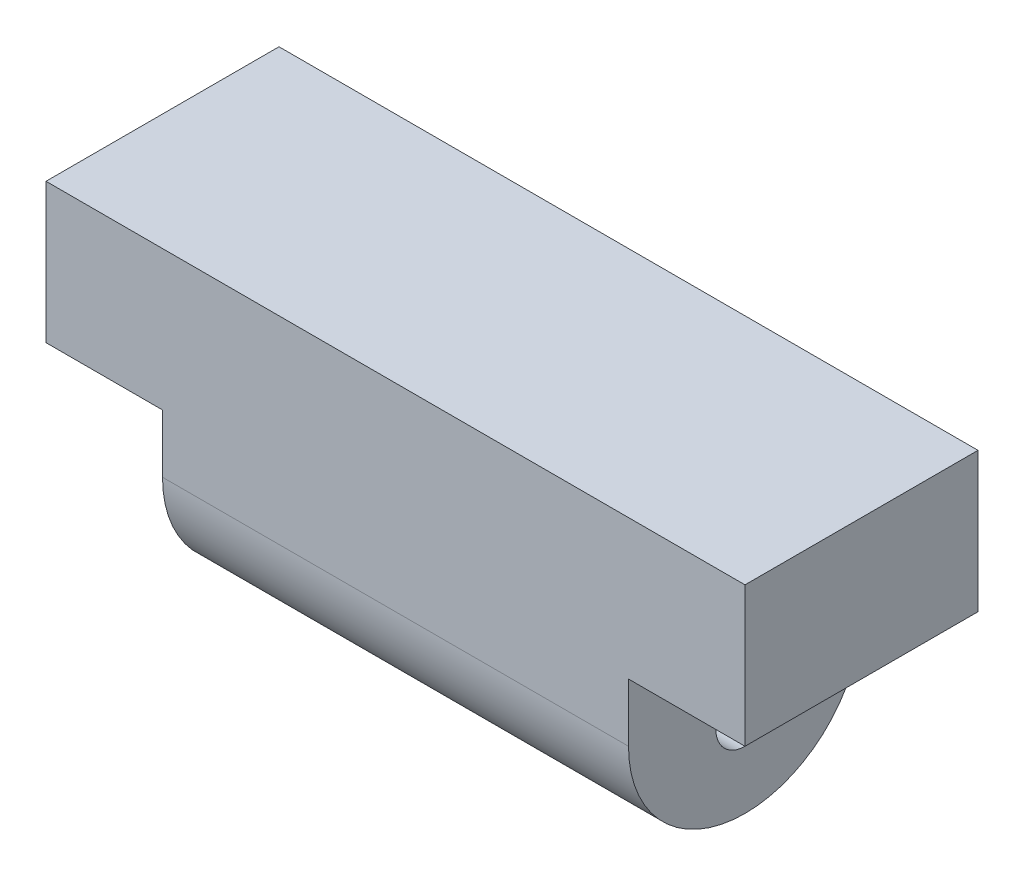
ISO-10303-21;
HEADER;
FILE_DESCRIPTION(('STEP AP214'),'2;1');
FILE_NAME('part.step','',(''),(''),'','','');
FILE_SCHEMA(('AUTOMOTIVE_DESIGN { 1 0 10303 214 1 1 1 1 }'));
ENDSEC;
DATA;
#1=APPLICATION_CONTEXT('core data for automotive mechanical design processes');
#2=APPLICATION_PROTOCOL_DEFINITION('international standard','automotive_design',2000,#1);
#3=PRODUCT_CONTEXT('',#1,'mechanical');
#4=PRODUCT('Part','Part','',(#3));
#5=PRODUCT_RELATED_PRODUCT_CATEGORY('part','',(#4));
#6=PRODUCT_DEFINITION_FORMATION('','',#4);
#7=PRODUCT_DEFINITION_CONTEXT('part definition',#1,'design');
#8=PRODUCT_DEFINITION('design','',#6,#7);
#9=PRODUCT_DEFINITION_SHAPE('','',#8);
#10=(LENGTH_UNIT() NAMED_UNIT(*) SI_UNIT(.MILLI.,.METRE.));
#11=(NAMED_UNIT(*) PLANE_ANGLE_UNIT() SI_UNIT($,.RADIAN.));
#12=(NAMED_UNIT(*) SI_UNIT($,.STERADIAN.) SOLID_ANGLE_UNIT());
#13=UNCERTAINTY_MEASURE_WITH_UNIT(LENGTH_MEASURE(1.E-05),#10,'distance_accuracy_value','');
#14=(GEOMETRIC_REPRESENTATION_CONTEXT(3) GLOBAL_UNCERTAINTY_ASSIGNED_CONTEXT((#13)) GLOBAL_UNIT_ASSIGNED_CONTEXT((#10,
#11,#12)) REPRESENTATION_CONTEXT('',''));
#15=CARTESIAN_POINT('',(0.,0.,0.));
#16=DIRECTION('',(0.,0.,1.));
#17=DIRECTION('',(1.,0.,0.));
#18=AXIS2_PLACEMENT_3D('',#15,#16,#17);
#19=CARTESIAN_POINT('',(-30.,1.49999999999999,20.));
#20=DIRECTION('',(1.,0.,0.));
#21=DIRECTION('',(0.,0.,-1.));
#22=AXIS2_PLACEMENT_3D('',#19,#20,#21);
#23=PLANE('',#22);
#24=DIRECTION('',(0.,-1.,0.));
#25=VECTOR('',#24,1.);
#26=CARTESIAN_POINT('',(-30.,1.49999999999999,0.));
#27=LINE('',#26,#25);
#28=CARTESIAN_POINT('',(-30.,13.5,0.));
#29=VERTEX_POINT('',#28);
#30=CARTESIAN_POINT('',(-30.,1.49999999999999,0.));
#31=VERTEX_POINT('',#30);
#32=EDGE_CURVE('E124',#29,#31,#27,.T.);
#33=ORIENTED_EDGE('',*,*,#32,.T.);
#34=DIRECTION('',(0.,0.,-1.));
#35=VECTOR('',#34,1.);
#36=CARTESIAN_POINT('',(-30.,1.49999999999999,20.));
#37=LINE('',#36,#35);
#38=CARTESIAN_POINT('',(-30.,1.49999999999999,20.));
#39=VERTEX_POINT('',#38);
#40=EDGE_CURVE('E106',#39,#31,#37,.T.);
#41=ORIENTED_EDGE('',*,*,#40,.F.);
#42=DIRECTION('',(0.,-1.,0.));
#43=VECTOR('',#42,1.);
#44=CARTESIAN_POINT('',(-30.,1.49999999999999,20.));
#45=LINE('',#44,#43);
#46=CARTESIAN_POINT('',(-30.,13.5,20.));
#47=VERTEX_POINT('',#46);
#48=EDGE_CURVE('E112',#47,#39,#45,.T.);
#49=ORIENTED_EDGE('',*,*,#48,.F.);
#50=DIRECTION('',(0.,0.,-1.));
#51=VECTOR('',#50,1.);
#52=CARTESIAN_POINT('',(-30.,13.5,20.));
#53=LINE('',#52,#51);
#54=EDGE_CURVE('E160',#47,#29,#53,.T.);
#55=ORIENTED_EDGE('',*,*,#54,.T.);
#56=EDGE_LOOP('',(#33,#41,#49,#55));
#57=FACE_BOUND('',#56,.T.);
#58=ADVANCED_FACE('F33',(#57),#23,.F.);
#59=CARTESIAN_POINT('',(-20.,1.49999999999999,20.));
#60=DIRECTION('',(0.,1.,0.));
#61=DIRECTION('',(-1.,0.,0.));
#62=AXIS2_PLACEMENT_3D('',#59,#60,#61);
#63=PLANE('',#62);
#64=DIRECTION('',(1.,0.,0.));
#65=VECTOR('',#64,1.);
#66=CARTESIAN_POINT('',(-20.,1.49999999999999,0.));
#67=LINE('',#66,#65);
#68=CARTESIAN_POINT('',(-20.,1.49999999999999,0.));
#69=VERTEX_POINT('',#68);
#70=EDGE_CURVE('E149',#31,#69,#67,.T.);
#71=ORIENTED_EDGE('',*,*,#70,.T.);
#72=DIRECTION('',(0.,0.,-1.));
#73=VECTOR('',#72,1.);
#74=CARTESIAN_POINT('',(-20.,1.49999999999999,20.));
#75=LINE('',#74,#73);
#76=CARTESIAN_POINT('',(-20.,1.49999999999999,20.));
#77=VERTEX_POINT('',#76);
#78=EDGE_CURVE('E109',#77,#69,#75,.T.);
#79=ORIENTED_EDGE('',*,*,#78,.F.);
#80=DIRECTION('',(1.,0.,0.));
#81=VECTOR('',#80,1.);
#82=CARTESIAN_POINT('',(-20.,1.49999999999999,20.));
#83=LINE('',#82,#81);
#84=EDGE_CURVE('E102',#39,#77,#83,.T.);
#85=ORIENTED_EDGE('',*,*,#84,.F.);
#86=ORIENTED_EDGE('',*,*,#40,.T.);
#87=EDGE_LOOP('',(#71,#79,#85,#86));
#88=FACE_BOUND('',#87,.T.);
#89=ADVANCED_FACE('F104',(#88),#63,.F.);
#90=CARTESIAN_POINT('',(-20.,-13.5,20.));
#91=DIRECTION('',(1.,0.,0.));
#92=DIRECTION('',(0.,1.,0.));
#93=AXIS2_PLACEMENT_3D('',#90,#91,#92);
#94=PLANE('',#93);
#95=CARTESIAN_POINT('',(-20.,-6.00000000000001,10.));
#96=DIRECTION('',(1.,0.,0.));
#97=DIRECTION('',(0.,1.,0.));
#98=AXIS2_PLACEMENT_3D('',#95,#96,#97);
#99=CIRCLE('',#98,2.5);
#100=CARTESIAN_POINT('',(-20.,-3.50000000000001,10.));
#101=VERTEX_POINT('',#100);
#102=EDGE_CURVE('E188',#101,#101,#99,.T.);
#103=ORIENTED_EDGE('',*,*,#102,.T.);
#104=EDGE_LOOP('',(#103));
#105=FACE_BOUND('',#104,.T.);
#106=DIRECTION('',(0.,-1.,0.));
#107=VECTOR('',#106,1.);
#108=CARTESIAN_POINT('',(-20.,-13.5,0.));
#109=LINE('',#108,#107);
#110=CARTESIAN_POINT('',(-20.,-3.50000000000001,0.));
#111=VERTEX_POINT('',#110);
#112=EDGE_CURVE('E143',#69,#111,#109,.T.);
#113=ORIENTED_EDGE('',*,*,#112,.T.);
#114=CARTESIAN_POINT('',(-20.,-3.50000000000001,10.));
#115=DIRECTION('',(1.,0.,0.));
#116=DIRECTION('',(0.,1.,0.));
#117=AXIS2_PLACEMENT_3D('',#114,#115,#116);
#118=CIRCLE('',#117,10.);
#119=CARTESIAN_POINT('',(-20.,-13.5,10.));
#120=VERTEX_POINT('',#119);
#121=EDGE_CURVE('E42',#111,#120,#118,.F.);
#122=ORIENTED_EDGE('',*,*,#121,.T.);
#123=CARTESIAN_POINT('',(-20.,-3.50000000000001,10.));
#124=DIRECTION('',(1.,0.,0.));
#125=DIRECTION('',(0.,1.,0.));
#126=AXIS2_PLACEMENT_3D('',#123,#124,#125);
#127=CIRCLE('',#126,10.);
#128=CARTESIAN_POINT('',(-20.,-3.50000000000001,20.));
#129=VERTEX_POINT('',#128);
#130=EDGE_CURVE('E49',#120,#129,#127,.F.);
#131=ORIENTED_EDGE('',*,*,#130,.T.);
#132=DIRECTION('',(0.,-1.,0.));
#133=VECTOR('',#132,1.);
#134=CARTESIAN_POINT('',(-20.,-13.5,20.));
#135=LINE('',#134,#133);
#136=EDGE_CURVE('E111',#77,#129,#135,.T.);
#137=ORIENTED_EDGE('',*,*,#136,.F.);
#138=ORIENTED_EDGE('',*,*,#78,.T.);
#139=EDGE_LOOP('',(#113,#122,#131,#137,#138));
#140=FACE_BOUND('',#139,.T.);
#141=ADVANCED_FACE('F148',(#105,#140),#94,.F.);
#142=CARTESIAN_POINT('',(20.,1.5,20.));
#143=DIRECTION('',(-1.,0.,0.));
#144=DIRECTION('',(0.,-1.,0.));
#145=AXIS2_PLACEMENT_3D('',#142,#143,#144);
#146=PLANE('',#145);
#147=CARTESIAN_POINT('',(20.,-6.,10.));
#148=DIRECTION('',(1.,0.,0.));
#149=DIRECTION('',(0.,1.,0.));
#150=AXIS2_PLACEMENT_3D('',#147,#148,#149);
#151=CIRCLE('',#150,2.5);
#152=CARTESIAN_POINT('',(20.,-3.5,10.));
#153=VERTEX_POINT('',#152);
#154=EDGE_CURVE('E190',#153,#153,#151,.T.);
#155=ORIENTED_EDGE('',*,*,#154,.F.);
#156=EDGE_LOOP('',(#155));
#157=FACE_BOUND('',#156,.T.);
#158=CARTESIAN_POINT('',(20.,-3.5,10.));
#159=DIRECTION('',(-1.,0.,0.));
#160=DIRECTION('',(0.,-1.,0.));
#161=AXIS2_PLACEMENT_3D('',#158,#159,#160);
#162=CIRCLE('',#161,10.);
#163=CARTESIAN_POINT('',(20.,-3.5,20.));
#164=VERTEX_POINT('',#163);
#165=CARTESIAN_POINT('',(20.,-13.5,10.));
#166=VERTEX_POINT('',#165);
#167=EDGE_CURVE('E125',#164,#166,#162,.F.);
#168=ORIENTED_EDGE('',*,*,#167,.T.);
#169=CARTESIAN_POINT('',(20.,-3.5,10.));
#170=DIRECTION('',(-1.,0.,0.));
#171=DIRECTION('',(0.,-1.,0.));
#172=AXIS2_PLACEMENT_3D('',#169,#170,#171);
#173=CIRCLE('',#172,10.);
#174=CARTESIAN_POINT('',(20.,-3.5,0.));
#175=VERTEX_POINT('',#174);
#176=EDGE_CURVE('E127',#166,#175,#173,.F.);
#177=ORIENTED_EDGE('',*,*,#176,.T.);
#178=DIRECTION('',(0.,1.,0.));
#179=VECTOR('',#178,1.);
#180=CARTESIAN_POINT('',(20.,1.5,0.));
#181=LINE('',#180,#179);
#182=CARTESIAN_POINT('',(20.,1.5,0.));
#183=VERTEX_POINT('',#182);
#184=EDGE_CURVE('E145',#175,#183,#181,.T.);
#185=ORIENTED_EDGE('',*,*,#184,.T.);
#186=DIRECTION('',(0.,0.,-1.));
#187=VECTOR('',#186,1.);
#188=CARTESIAN_POINT('',(20.,1.5,20.));
#189=LINE('',#188,#187);
#190=CARTESIAN_POINT('',(20.,1.5,20.));
#191=VERTEX_POINT('',#190);
#192=EDGE_CURVE('E129',#191,#183,#189,.T.);
#193=ORIENTED_EDGE('',*,*,#192,.F.);
#194=DIRECTION('',(0.,1.,0.));
#195=VECTOR('',#194,1.);
#196=CARTESIAN_POINT('',(20.,1.5,20.));
#197=LINE('',#196,#195);
#198=EDGE_CURVE('E198',#164,#191,#197,.T.);
#199=ORIENTED_EDGE('',*,*,#198,.F.);
#200=EDGE_LOOP('',(#168,#177,#185,#193,#199));
#201=FACE_BOUND('',#200,.T.);
#202=ADVANCED_FACE('F201',(#157,#201),#146,.F.);
#203=CARTESIAN_POINT('',(30.,1.5,20.));
#204=DIRECTION('',(0.,1.,0.));
#205=DIRECTION('',(-1.,0.,0.));
#206=AXIS2_PLACEMENT_3D('',#203,#204,#205);
#207=PLANE('',#206);
#208=DIRECTION('',(1.,0.,0.));
#209=VECTOR('',#208,1.);
#210=CARTESIAN_POINT('',(30.,1.5,0.));
#211=LINE('',#210,#209);
#212=CARTESIAN_POINT('',(30.,1.5,0.));
#213=VERTEX_POINT('',#212);
#214=EDGE_CURVE('E151',#183,#213,#211,.T.);
#215=ORIENTED_EDGE('',*,*,#214,.T.);
#216=DIRECTION('',(0.,0.,-1.));
#217=VECTOR('',#216,1.);
#218=CARTESIAN_POINT('',(30.,1.5,20.));
#219=LINE('',#218,#217);
#220=CARTESIAN_POINT('',(30.,1.5,20.));
#221=VERTEX_POINT('',#220);
#222=EDGE_CURVE('E165',#221,#213,#219,.T.);
#223=ORIENTED_EDGE('',*,*,#222,.F.);
#224=DIRECTION('',(1.,0.,0.));
#225=VECTOR('',#224,1.);
#226=CARTESIAN_POINT('',(30.,1.5,20.));
#227=LINE('',#226,#225);
#228=EDGE_CURVE('E173',#191,#221,#227,.T.);
#229=ORIENTED_EDGE('',*,*,#228,.F.);
#230=ORIENTED_EDGE('',*,*,#192,.T.);
#231=EDGE_LOOP('',(#215,#223,#229,#230));
#232=FACE_BOUND('',#231,.T.);
#233=ADVANCED_FACE('F171',(#232),#207,.F.);
#234=CARTESIAN_POINT('',(30.,13.5,20.));
#235=DIRECTION('',(-1.,0.,0.));
#236=DIRECTION('',(0.,0.,1.));
#237=AXIS2_PLACEMENT_3D('',#234,#235,#236);
#238=PLANE('',#237);
#239=DIRECTION('',(0.,1.,0.));
#240=VECTOR('',#239,1.);
#241=CARTESIAN_POINT('',(30.,13.5,0.));
#242=LINE('',#241,#240);
#243=CARTESIAN_POINT('',(30.,13.5,0.));
#244=VERTEX_POINT('',#243);
#245=EDGE_CURVE('E157',#213,#244,#242,.T.);
#246=ORIENTED_EDGE('',*,*,#245,.T.);
#247=DIRECTION('',(0.,0.,-1.));
#248=VECTOR('',#247,1.);
#249=CARTESIAN_POINT('',(30.,13.5,20.));
#250=LINE('',#249,#248);
#251=CARTESIAN_POINT('',(30.,13.5,20.));
#252=VERTEX_POINT('',#251);
#253=EDGE_CURVE('E162',#252,#244,#250,.T.);
#254=ORIENTED_EDGE('',*,*,#253,.F.);
#255=DIRECTION('',(0.,1.,0.));
#256=VECTOR('',#255,1.);
#257=CARTESIAN_POINT('',(30.,13.5,20.));
#258=LINE('',#257,#256);
#259=EDGE_CURVE('E184',#221,#252,#258,.T.);
#260=ORIENTED_EDGE('',*,*,#259,.F.);
#261=ORIENTED_EDGE('',*,*,#222,.T.);
#262=EDGE_LOOP('',(#246,#254,#260,#261));
#263=FACE_BOUND('',#262,.T.);
#264=ADVANCED_FACE('F180',(#263),#238,.F.);
#265=CARTESIAN_POINT('',(-30.,13.5,20.));
#266=DIRECTION('',(0.,-1.,0.));
#267=DIRECTION('',(1.,0.,0.));
#268=AXIS2_PLACEMENT_3D('',#265,#266,#267);
#269=PLANE('',#268);
#270=DIRECTION('',(-1.,0.,0.));
#271=VECTOR('',#270,1.);
#272=CARTESIAN_POINT('',(-30.,13.5,0.));
#273=LINE('',#272,#271);
#274=EDGE_CURVE('E121',#244,#29,#273,.T.);
#275=ORIENTED_EDGE('',*,*,#274,.T.);
#276=ORIENTED_EDGE('',*,*,#54,.F.);
#277=DIRECTION('',(-1.,0.,0.));
#278=VECTOR('',#277,1.);
#279=CARTESIAN_POINT('',(-30.,13.5,20.));
#280=LINE('',#279,#278);
#281=EDGE_CURVE('E117',#252,#47,#280,.T.);
#282=ORIENTED_EDGE('',*,*,#281,.F.);
#283=ORIENTED_EDGE('',*,*,#253,.T.);
#284=EDGE_LOOP('',(#275,#276,#282,#283));
#285=FACE_BOUND('',#284,.T.);
#286=ADVANCED_FACE('F183',(#285),#269,.F.);
#287=CARTESIAN_POINT('',(0.,0.,20.));
#288=DIRECTION('',(0.,0.,-1.));
#289=DIRECTION('',(-1.,0.,0.));
#290=AXIS2_PLACEMENT_3D('',#287,#288,#289);
#291=PLANE('',#290);
#292=ORIENTED_EDGE('',*,*,#136,.T.);
#293=DIRECTION('',(1.,0.,0.));
#294=VECTOR('',#293,1.);
#295=CARTESIAN_POINT('',(0.,-3.5,20.));
#296=LINE('',#295,#294);
#297=EDGE_CURVE('E11',#129,#164,#296,.T.);
#298=ORIENTED_EDGE('',*,*,#297,.T.);
#299=ORIENTED_EDGE('',*,*,#198,.T.);
#300=ORIENTED_EDGE('',*,*,#228,.T.);
#301=ORIENTED_EDGE('',*,*,#259,.T.);
#302=ORIENTED_EDGE('',*,*,#281,.T.);
#303=ORIENTED_EDGE('',*,*,#48,.T.);
#304=ORIENTED_EDGE('',*,*,#84,.T.);
#305=EDGE_LOOP('',(#292,#298,#299,#300,#301,#302,#303,#304));
#306=FACE_BOUND('',#305,.T.);
#307=ADVANCED_FACE('F115',(#306),#291,.F.);
#308=CARTESIAN_POINT('',(0.,0.,0.));
#309=DIRECTION('',(0.,0.,-1.));
#310=DIRECTION('',(-1.,0.,0.));
#311=AXIS2_PLACEMENT_3D('',#308,#309,#310);
#312=PLANE('',#311);
#313=ORIENTED_EDGE('',*,*,#184,.F.);
#314=DIRECTION('',(1.,0.,0.));
#315=VECTOR('',#314,1.);
#316=CARTESIAN_POINT('',(-20.,-3.50000000000001,0.));
#317=LINE('',#316,#315);
#318=EDGE_CURVE('E134',#175,#111,#317,.F.);
#319=ORIENTED_EDGE('',*,*,#318,.T.);
#320=ORIENTED_EDGE('',*,*,#112,.F.);
#321=ORIENTED_EDGE('',*,*,#70,.F.);
#322=ORIENTED_EDGE('',*,*,#32,.F.);
#323=ORIENTED_EDGE('',*,*,#274,.F.);
#324=ORIENTED_EDGE('',*,*,#245,.F.);
#325=ORIENTED_EDGE('',*,*,#214,.F.);
#326=EDGE_LOOP('',(#313,#319,#320,#321,#322,#323,#324,#325));
#327=FACE_BOUND('',#326,.T.);
#328=ADVANCED_FACE('F142',(#327),#312,.T.);
#329=CARTESIAN_POINT('',(-30.,-6.00000000000001,10.));
#330=DIRECTION('',(1.,0.,0.));
#331=DIRECTION('',(0.,1.,0.));
#332=AXIS2_PLACEMENT_3D('',#329,#330,#331);
#333=CYLINDRICAL_SURFACE('',#332,2.5);
#334=CARTESIAN_POINT('',(20.,-3.5,10.));
#335=CARTESIAN_POINT('',(19.5833333333333,-3.5,10.));
#336=CARTESIAN_POINT('',(19.1666666666667,-3.5,10.));
#337=CARTESIAN_POINT('',(18.3333333333333,-3.5,10.));
#338=CARTESIAN_POINT('',(17.9166666666667,-3.5,10.));
#339=CARTESIAN_POINT('',(17.0833333333333,-3.5,10.));
#340=CARTESIAN_POINT('',(16.6666666666667,-3.5,10.));
#341=CARTESIAN_POINT('',(15.8333333333333,-3.5,10.));
#342=CARTESIAN_POINT('',(15.4166666666667,-3.5,10.));
#343=CARTESIAN_POINT('',(14.5833333333333,-3.5,10.));
#344=CARTESIAN_POINT('',(14.1666666666667,-3.5,10.));
#345=CARTESIAN_POINT('',(13.3333333333333,-3.5,10.));
#346=CARTESIAN_POINT('',(12.9166666666667,-3.5,10.));
#347=CARTESIAN_POINT('',(12.0833333333333,-3.5,10.));
#348=CARTESIAN_POINT('',(11.6666666666667,-3.5,10.));
#349=CARTESIAN_POINT('',(10.8333333333333,-3.5,10.));
#350=CARTESIAN_POINT('',(10.4166666666667,-3.5,10.));
#351=CARTESIAN_POINT('',(9.58333333333333,-3.5,10.));
#352=CARTESIAN_POINT('',(9.16666666666667,-3.5,10.));
#353=CARTESIAN_POINT('',(8.33333333333333,-3.5,10.));
#354=CARTESIAN_POINT('',(7.91666666666667,-3.5,10.));
#355=CARTESIAN_POINT('',(7.08333333333333,-3.5,10.));
#356=CARTESIAN_POINT('',(6.66666666666667,-3.5,10.));
#357=CARTESIAN_POINT('',(5.83333333333333,-3.5,10.));
#358=CARTESIAN_POINT('',(5.41666666666666,-3.5,10.));
#359=CARTESIAN_POINT('',(4.58333333333333,-3.5,10.));
#360=CARTESIAN_POINT('',(4.16666666666666,-3.5,10.));
#361=CARTESIAN_POINT('',(3.33333333333333,-3.5,10.));
#362=CARTESIAN_POINT('',(2.91666666666666,-3.5,10.));
#363=CARTESIAN_POINT('',(2.08333333333333,-3.5,10.));
#364=CARTESIAN_POINT('',(1.66666666666667,-3.5,10.));
#365=CARTESIAN_POINT('',(0.833333333333335,-3.5,10.));
#366=CARTESIAN_POINT('',(0.416666666666669,-3.5,10.));
#367=CARTESIAN_POINT('',(-0.416666666666664,-3.5,10.));
#368=CARTESIAN_POINT('',(-0.833333333333331,-3.50000000000001,10.));
#369=CARTESIAN_POINT('',(-1.66666666666666,-3.50000000000001,10.));
#370=CARTESIAN_POINT('',(-2.08333333333333,-3.50000000000001,10.));
#371=CARTESIAN_POINT('',(-2.91666666666666,-3.50000000000001,10.));
#372=CARTESIAN_POINT('',(-3.33333333333333,-3.50000000000001,10.));
#373=CARTESIAN_POINT('',(-4.16666666666666,-3.50000000000001,10.));
#374=CARTESIAN_POINT('',(-4.58333333333333,-3.50000000000001,10.));
#375=CARTESIAN_POINT('',(-5.41666666666666,-3.50000000000001,10.));
#376=CARTESIAN_POINT('',(-5.83333333333333,-3.50000000000001,10.));
#377=CARTESIAN_POINT('',(-6.66666666666666,-3.50000000000001,10.));
#378=CARTESIAN_POINT('',(-7.08333333333333,-3.50000000000001,10.));
#379=CARTESIAN_POINT('',(-7.91666666666666,-3.50000000000001,10.));
#380=CARTESIAN_POINT('',(-8.33333333333333,-3.50000000000001,10.));
#381=CARTESIAN_POINT('',(-9.16666666666666,-3.50000000000001,10.));
#382=CARTESIAN_POINT('',(-9.58333333333333,-3.50000000000001,10.));
#383=CARTESIAN_POINT('',(-10.4166666666667,-3.50000000000001,10.));
#384=CARTESIAN_POINT('',(-10.8333333333333,-3.50000000000001,10.));
#385=CARTESIAN_POINT('',(-11.6666666666667,-3.50000000000001,10.));
#386=CARTESIAN_POINT('',(-12.0833333333333,-3.50000000000001,10.));
#387=CARTESIAN_POINT('',(-12.9166666666667,-3.50000000000001,10.));
#388=CARTESIAN_POINT('',(-13.3333333333333,-3.50000000000001,10.));
#389=CARTESIAN_POINT('',(-14.1666666666667,-3.50000000000001,10.));
#390=CARTESIAN_POINT('',(-14.5833333333333,-3.50000000000001,10.));
#391=CARTESIAN_POINT('',(-15.4166666666667,-3.50000000000001,10.));
#392=CARTESIAN_POINT('',(-15.8333333333333,-3.50000000000001,10.));
#393=CARTESIAN_POINT('',(-16.6666666666667,-3.50000000000001,10.));
#394=CARTESIAN_POINT('',(-17.0833333333333,-3.50000000000001,10.));
#395=CARTESIAN_POINT('',(-17.9166666666667,-3.50000000000001,10.));
#396=CARTESIAN_POINT('',(-18.3333333333333,-3.50000000000001,10.));
#397=CARTESIAN_POINT('',(-19.1666666666667,-3.50000000000001,10.));
#398=CARTESIAN_POINT('',(-19.5833333333333,-3.50000000000001,10.));
#399=CARTESIAN_POINT('',(-20.,-3.50000000000001,10.));
#400=B_SPLINE_CURVE_WITH_KNOTS('',3,(#334,#335,#336,#337,#338,#339,#340,#341,#342,#343,#344,
#345,#346,#347,#348,#349,#350,#351,#352,#353,#354,#355,#356,#357,#358,#359,#360,#361,#362,#363,
#364,#365,#366,#367,#368,#369,#370,#371,#372,#373,#374,#375,#376,#377,#378,#379,#380,#381,#382,
#383,#384,#385,#386,#387,#388,#389,#390,#391,#392,#393,#394,#395,#396,#397,#398,#399),
.UNSPECIFIED.,.F.,.F.,(4,2,2,2,2,2,2,2,2,2,2,2,2,2,2,2,2,2,2,2,2,2,2,2,2,2,2,2,2,2,2,2,4),(0.,
1.25,2.5,3.75,5.,6.25,7.5,8.75,9.99999999999999,11.25,12.5,13.75,15.,16.25,17.5,18.75,20.,21.25,
22.5,23.75,25.,26.25,27.5,28.75,30.,31.25,32.5,33.75,35.,36.25,37.5,38.75,40.),.UNSPECIFIED.);
#401=EDGE_CURVE('BSEAM210',#153,#101,#400,.T.);
#402=ORIENTED_EDGE('',*,*,#154,.T.);
#403=ORIENTED_EDGE('',*,*,#102,.F.);
#404=ORIENTED_EDGE('',*,*,#401,.T.);
#405=ORIENTED_EDGE('',*,*,#401,.F.);
#406=EDGE_LOOP('',(#402,#404,#403,#405));
#407=FACE_BOUND('',#406,.T.);
#408=ADVANCED_FACE('F210',(#407),#333,.F.);
#409=CARTESIAN_POINT('',(0.,-3.5,10.));
#410=DIRECTION('',(1.,0.,0.));
#411=DIRECTION('',(0.,1.,0.));
#412=AXIS2_PLACEMENT_3D('',#409,#410,#411);
#413=CYLINDRICAL_SURFACE('',#412,10.);
#414=ORIENTED_EDGE('',*,*,#297,.F.);
#415=ORIENTED_EDGE('',*,*,#130,.F.);
#416=DIRECTION('',(1.,0.,0.));
#417=VECTOR('',#416,1.);
#418=CARTESIAN_POINT('',(20.,-13.5,10.));
#419=LINE('',#418,#417);
#420=EDGE_CURVE('E37',#166,#120,#419,.F.);
#421=ORIENTED_EDGE('',*,*,#420,.F.);
#422=ORIENTED_EDGE('',*,*,#167,.F.);
#423=EDGE_LOOP('',(#414,#415,#421,#422));
#424=FACE_BOUND('',#423,.T.);
#425=ADVANCED_FACE('F35',(#424),#413,.T.);
#426=CARTESIAN_POINT('',(20.,-3.5,10.));
#427=DIRECTION('',(-1.,0.,0.));
#428=DIRECTION('',(0.,-1.,0.));
#429=AXIS2_PLACEMENT_3D('',#426,#427,#428);
#430=CYLINDRICAL_SURFACE('',#429,10.);
#431=ORIENTED_EDGE('',*,*,#121,.F.);
#432=ORIENTED_EDGE('',*,*,#318,.F.);
#433=ORIENTED_EDGE('',*,*,#176,.F.);
#434=ORIENTED_EDGE('',*,*,#420,.T.);
#435=EDGE_LOOP('',(#431,#432,#433,#434));
#436=FACE_BOUND('',#435,.T.);
#437=ADVANCED_FACE('F205',(#436),#430,.T.);
#438=CLOSED_SHELL('',(#58,#89,#141,#202,#233,#264,#286,#307,#328,#408,#425,#437));
#439=MANIFOLD_SOLID_BREP('B2',#438);
#440=ADVANCED_BREP_SHAPE_REPRESENTATION('',(#18,#439),#14);
#441=SHAPE_DEFINITION_REPRESENTATION(#9,#440);
ENDSEC;
END-ISO-10303-21;
